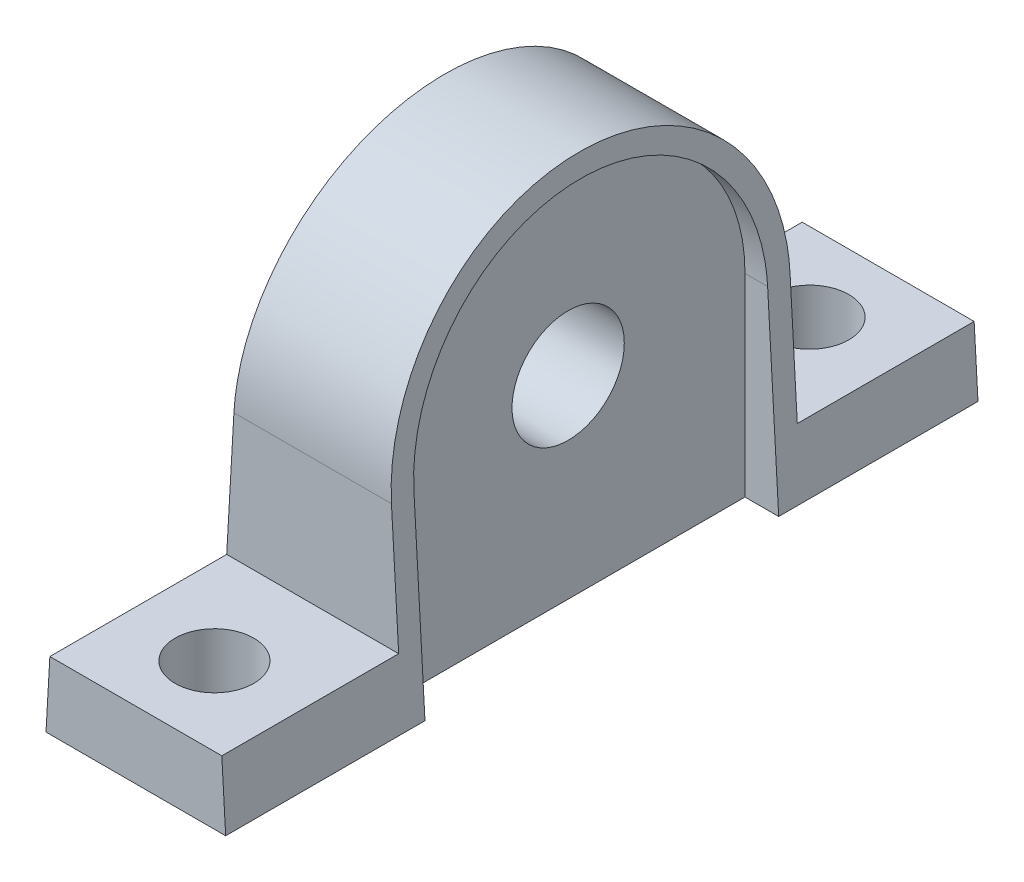
ISO-10303-21;
HEADER;
FILE_DESCRIPTION(('STEP AP214'),'2;1');
FILE_NAME('part.step','',(''),(''),'','','');
FILE_SCHEMA(('AUTOMOTIVE_DESIGN { 1 0 10303 214 1 1 1 1 }'));
ENDSEC;
DATA;
#1=APPLICATION_CONTEXT('core data for automotive mechanical design processes');
#2=APPLICATION_PROTOCOL_DEFINITION('international standard','automotive_design',2000,#1);
#3=PRODUCT_CONTEXT('',#1,'mechanical');
#4=PRODUCT('Part','Part','',(#3));
#5=PRODUCT_RELATED_PRODUCT_CATEGORY('part','',(#4));
#6=PRODUCT_DEFINITION_FORMATION('','',#4);
#7=PRODUCT_DEFINITION_CONTEXT('part definition',#1,'design');
#8=PRODUCT_DEFINITION('design','',#6,#7);
#9=PRODUCT_DEFINITION_SHAPE('','',#8);
#10=(LENGTH_UNIT() NAMED_UNIT(*) SI_UNIT(.MILLI.,.METRE.));
#11=(NAMED_UNIT(*) PLANE_ANGLE_UNIT() SI_UNIT($,.RADIAN.));
#12=(NAMED_UNIT(*) SI_UNIT($,.STERADIAN.) SOLID_ANGLE_UNIT());
#13=UNCERTAINTY_MEASURE_WITH_UNIT(LENGTH_MEASURE(1.E-05),#10,'distance_accuracy_value','');
#14=(GEOMETRIC_REPRESENTATION_CONTEXT(3) GLOBAL_UNCERTAINTY_ASSIGNED_CONTEXT((#13)) GLOBAL_UNIT_ASSIGNED_CONTEXT((#10,
#11,#12)) REPRESENTATION_CONTEXT('',''));
#15=CARTESIAN_POINT('',(0.,0.,0.));
#16=DIRECTION('',(0.,0.,1.));
#17=DIRECTION('',(1.,0.,0.));
#18=AXIS2_PLACEMENT_3D('',#15,#16,#17);
#19=CARTESIAN_POINT('',(-5.,0.,0.));
#20=DIRECTION('',(-1.,0.,0.));
#21=DIRECTION('',(0.,0.,-1.));
#22=AXIS2_PLACEMENT_3D('',#19,#20,#21);
#23=PLANE('',#22);
#24=DIRECTION('',(0.,-1.,0.));
#25=VECTOR('',#24,1.);
#26=CARTESIAN_POINT('',(-5.,0.,17.75));
#27=LINE('',#26,#25);
#28=CARTESIAN_POINT('',(-5.,17.25,17.75));
#29=VERTEX_POINT('',#28);
#30=CARTESIAN_POINT('',(-5.,0.,17.75));
#31=VERTEX_POINT('',#30);
#32=EDGE_CURVE('E193',#29,#31,#27,.T.);
#33=ORIENTED_EDGE('',*,*,#32,.T.);
#34=DIRECTION('',(0.,0.,-1.));
#35=VECTOR('',#34,1.);
#36=CARTESIAN_POINT('',(-5.,0.,0.));
#37=LINE('',#36,#35);
#38=CARTESIAN_POINT('',(-5.,0.,49.25));
#39=VERTEX_POINT('',#38);
#40=EDGE_CURVE('E204',#39,#31,#37,.T.);
#41=ORIENTED_EDGE('',*,*,#40,.F.);
#42=DIRECTION('',(0.,-1.,0.));
#43=VECTOR('',#42,1.);
#44=CARTESIAN_POINT('',(-5.,0.,49.25));
#45=LINE('',#44,#43);
#46=CARTESIAN_POINT('',(-5.,17.25,49.25));
#47=VERTEX_POINT('',#46);
#48=EDGE_CURVE('E209',#47,#39,#45,.T.);
#49=ORIENTED_EDGE('',*,*,#48,.F.);
#50=CARTESIAN_POINT('',(-5.,17.25,33.5));
#51=DIRECTION('',(1.,0.,0.));
#52=DIRECTION('',(0.,0.,-1.));
#53=AXIS2_PLACEMENT_3D('',#50,#51,#52);
#54=CIRCLE('',#53,15.75);
#55=EDGE_CURVE('E197',#29,#47,#54,.T.);
#56=ORIENTED_EDGE('',*,*,#55,.F.);
#57=EDGE_LOOP('',(#33,#41,#49,#56));
#58=FACE_BOUND('',#57,.T.);
#59=CARTESIAN_POINT('',(-5.,17.25,33.5));
#60=DIRECTION('',(-1.,0.,0.));
#61=DIRECTION('',(0.,0.,1.));
#62=AXIS2_PLACEMENT_3D('',#59,#60,#61);
#63=CIRCLE('',#62,7.);
#64=CARTESIAN_POINT('',(-5.,17.25,40.5));
#65=VERTEX_POINT('',#64);
#66=EDGE_CURVE('E325',#65,#65,#63,.T.);
#67=ORIENTED_EDGE('',*,*,#66,.F.);
#68=EDGE_LOOP('',(#67));
#69=FACE_BOUND('',#68,.T.);
#70=ADVANCED_FACE('F72',(#58,#69),#23,.T.);
#71=CARTESIAN_POINT('',(-15.,17.25,33.5));
#72=DIRECTION('',(1.,0.,0.));
#73=DIRECTION('',(0.,0.,-1.));
#74=AXIS2_PLACEMENT_3D('',#71,#72,#73);
#75=CYLINDRICAL_SURFACE('',#74,5.);
#76=CARTESIAN_POINT('',(5.,17.25,33.5));
#77=DIRECTION('',(1.,0.,0.));
#78=DIRECTION('',(0.,0.,-1.));
#79=AXIS2_PLACEMENT_3D('',#76,#77,#78);
#80=CIRCLE('',#79,5.);
#81=CARTESIAN_POINT('',(5.,17.25,28.5));
#82=VERTEX_POINT('',#81);
#83=EDGE_CURVE('E231',#82,#82,#80,.F.);
#84=ORIENTED_EDGE('',*,*,#83,.F.);
#85=EDGE_LOOP('',(#84));
#86=FACE_BOUND('',#85,.T.);
#87=CARTESIAN_POINT('',(-10.,17.25,33.5));
#88=DIRECTION('',(1.,0.,0.));
#89=DIRECTION('',(0.,0.,-1.));
#90=AXIS2_PLACEMENT_3D('',#87,#88,#89);
#91=CIRCLE('',#90,5.);
#92=CARTESIAN_POINT('',(-10.,17.25,28.5));
#93=VERTEX_POINT('',#92);
#94=EDGE_CURVE('E320',#93,#93,#91,.T.);
#95=ORIENTED_EDGE('',*,*,#94,.F.);
#96=EDGE_LOOP('',(#95));
#97=FACE_BOUND('',#96,.T.);
#98=ADVANCED_FACE('F342',(#86,#97),#75,.F.);
#99=CARTESIAN_POINT('',(8.,0.,67.));
#100=DIRECTION('',(-0.998371334423977,-0.0570497905385129,0.));
#101=DIRECTION('',(0.0570497905385129,-0.998371334423977,0.));
#102=AXIS2_PLACEMENT_3D('',#99,#100,#101);
#103=PLANE('',#102);
#104=DIRECTION('',(-0.0570497905385129,0.998371334423977,0.));
#105=VECTOR('',#104,1.);
#106=CARTESIAN_POINT('',(8.,0.,17.75));
#107=LINE('',#106,#105);
#108=CARTESIAN_POINT('',(8.,0.,17.75));
#109=VERTEX_POINT('',#108);
#110=CARTESIAN_POINT('',(7.01428571428572,17.25,17.75));
#111=VERTEX_POINT('',#110);
#112=EDGE_CURVE('E243',#109,#111,#107,.T.);
#113=ORIENTED_EDGE('',*,*,#112,.F.);
#114=DIRECTION('',(0.,0.,-1.));
#115=VECTOR('',#114,1.);
#116=CARTESIAN_POINT('',(8.,0.,67.));
#117=LINE('',#116,#115);
#118=CARTESIAN_POINT('',(8.,0.,0.));
#119=VERTEX_POINT('',#118);
#120=EDGE_CURVE('E283',#109,#119,#117,.T.);
#121=ORIENTED_EDGE('',*,*,#120,.T.);
#122=DIRECTION('',(-0.0570497905385129,0.998371334423977,0.));
#123=VECTOR('',#122,1.);
#124=CARTESIAN_POINT('',(8.,0.,0.));
#125=LINE('',#124,#123);
#126=CARTESIAN_POINT('',(7.65714285714286,6.,0.));
#127=VERTEX_POINT('',#126);
#128=EDGE_CURVE('E274',#119,#127,#125,.T.);
#129=ORIENTED_EDGE('',*,*,#128,.T.);
#130=DIRECTION('',(0.,0.,-1.));
#131=VECTOR('',#130,1.);
#132=CARTESIAN_POINT('',(7.65714285714286,6.,67.));
#133=LINE('',#132,#131);
#134=CARTESIAN_POINT('',(7.65714285714286,6.,15.75));
#135=VERTEX_POINT('',#134);
#136=EDGE_CURVE('E268',#135,#127,#133,.T.);
#137=ORIENTED_EDGE('',*,*,#136,.F.);
#138=DIRECTION('',(0.0570497905385129,-0.998371334423977,0.));
#139=VECTOR('',#138,1.);
#140=CARTESIAN_POINT('',(8.,0.,15.75));
#141=LINE('',#140,#139);
#142=CARTESIAN_POINT('',(7.01428571428572,17.25,15.75));
#143=VERTEX_POINT('',#142);
#144=EDGE_CURVE('E272',#143,#135,#141,.T.);
#145=ORIENTED_EDGE('',*,*,#144,.F.);
#146=CARTESIAN_POINT('',(7.01428571428572,17.25,33.5));
#147=DIRECTION('',(-0.998371334423977,-0.0570497905385129,0.));
#148=DIRECTION('',(0.057049790538513,-0.998371334423977,0.));
#149=AXIS2_PLACEMENT_3D('',#146,#147,#148);
#150=ELLIPSE('',#149,17.7789559735718,17.75);
#151=CARTESIAN_POINT('',(7.01428571428572,17.25,51.25));
#152=VERTEX_POINT('',#151);
#153=EDGE_CURVE('E270',#143,#152,#150,.F.);
#154=ORIENTED_EDGE('',*,*,#153,.T.);
#155=DIRECTION('',(0.0570497905385129,-0.998371334423977,0.));
#156=VECTOR('',#155,1.);
#157=CARTESIAN_POINT('',(8.,0.,51.25));
#158=LINE('',#157,#156);
#159=CARTESIAN_POINT('',(7.65714285714286,6.,51.25));
#160=VERTEX_POINT('',#159);
#161=EDGE_CURVE('E257',#152,#160,#158,.T.);
#162=ORIENTED_EDGE('',*,*,#161,.T.);
#163=DIRECTION('',(0.,0.,1.));
#164=VECTOR('',#163,1.);
#165=CARTESIAN_POINT('',(7.65714285714286,6.,67.));
#166=LINE('',#165,#164);
#167=CARTESIAN_POINT('',(7.65714285714286,6.,67.));
#168=VERTEX_POINT('',#167);
#169=EDGE_CURVE('E254',#160,#168,#166,.T.);
#170=ORIENTED_EDGE('',*,*,#169,.T.);
#171=DIRECTION('',(-0.0570497905385129,0.998371334423977,0.));
#172=VECTOR('',#171,1.);
#173=CARTESIAN_POINT('',(8.,0.,67.));
#174=LINE('',#173,#172);
#175=CARTESIAN_POINT('',(8.,0.,67.));
#176=VERTEX_POINT('',#175);
#177=EDGE_CURVE('E275',#176,#168,#174,.T.);
#178=ORIENTED_EDGE('',*,*,#177,.F.);
#179=CARTESIAN_POINT('',(8.,0.,49.25));
#180=VERTEX_POINT('',#179);
#181=EDGE_CURVE('E291',#176,#180,#117,.T.);
#182=ORIENTED_EDGE('',*,*,#181,.T.);
#183=DIRECTION('',(-0.0570497905385129,0.998371334423977,0.));
#184=VECTOR('',#183,1.);
#185=CARTESIAN_POINT('',(8.,0.,49.25));
#186=LINE('',#185,#184);
#187=CARTESIAN_POINT('',(7.01428571428572,17.25,49.25));
#188=VERTEX_POINT('',#187);
#189=EDGE_CURVE('E240',#180,#188,#186,.T.);
#190=ORIENTED_EDGE('',*,*,#189,.T.);
#191=CARTESIAN_POINT('',(7.01428571428572,17.25,33.5));
#192=DIRECTION('',(-0.998371334423977,-0.0570497905385129,0.));
#193=DIRECTION('',(0.057049790538513,-0.998371334423977,0.));
#194=AXIS2_PLACEMENT_3D('',#191,#192,#193);
#195=ELLIPSE('',#194,15.7756933286623,15.75);
#196=EDGE_CURVE('E311',#188,#111,#195,.T.);
#197=ORIENTED_EDGE('',*,*,#196,.T.);
#198=EDGE_LOOP('',(#113,#121,#129,#137,#145,#154,#162,#170,#178,#182,#190,#197));
#199=FACE_BOUND('',#198,.T.);
#200=ADVANCED_FACE('F74',(#199),#103,.F.);
#201=CARTESIAN_POINT('',(8.,0.,67.));
#202=DIRECTION('',(0.,1.,0.));
#203=DIRECTION('',(0.,0.,1.));
#204=AXIS2_PLACEMENT_3D('',#201,#202,#203);
#205=PLANE('',#204);
#206=CARTESIAN_POINT('',(0.,0.,7.00000000000001));
#207=DIRECTION('',(0.,-1.,0.));
#208=DIRECTION('',(0.,0.,1.));
#209=AXIS2_PLACEMENT_3D('',#206,#207,#208);
#210=CIRCLE('',#209,3.5);
#211=CARTESIAN_POINT('',(0.,0.,10.5));
#212=VERTEX_POINT('',#211);
#213=EDGE_CURVE('E332',#212,#212,#210,.T.);
#214=ORIENTED_EDGE('',*,*,#213,.F.);
#215=EDGE_LOOP('',(#214));
#216=FACE_BOUND('',#215,.T.);
#217=CARTESIAN_POINT('',(0.,0.,60.));
#218=DIRECTION('',(0.,-1.,0.));
#219=DIRECTION('',(0.,0.,-1.));
#220=AXIS2_PLACEMENT_3D('',#217,#218,#219);
#221=CIRCLE('',#220,3.5);
#222=CARTESIAN_POINT('',(0.,0.,56.5));
#223=VERTEX_POINT('',#222);
#224=EDGE_CURVE('E321',#223,#223,#221,.T.);
#225=ORIENTED_EDGE('',*,*,#224,.F.);
#226=EDGE_LOOP('',(#225));
#227=FACE_BOUND('',#226,.T.);
#228=ORIENTED_EDGE('',*,*,#40,.T.);
#229=DIRECTION('',(-1.,0.,0.));
#230=VECTOR('',#229,1.);
#231=CARTESIAN_POINT('',(-5.,0.,17.75));
#232=LINE('',#231,#230);
#233=CARTESIAN_POINT('',(-8.,0.,17.75));
#234=VERTEX_POINT('',#233);
#235=EDGE_CURVE('E189',#31,#234,#232,.T.);
#236=ORIENTED_EDGE('',*,*,#235,.T.);
#237=DIRECTION('',(0.,0.,-1.));
#238=VECTOR('',#237,1.);
#239=CARTESIAN_POINT('',(-8.,0.,67.));
#240=LINE('',#239,#238);
#241=CARTESIAN_POINT('',(-8.,0.,0.));
#242=VERTEX_POINT('',#241);
#243=EDGE_CURVE('E294',#234,#242,#240,.T.);
#244=ORIENTED_EDGE('',*,*,#243,.T.);
#245=DIRECTION('',(1.,0.,0.));
#246=VECTOR('',#245,1.);
#247=CARTESIAN_POINT('',(8.,0.,0.));
#248=LINE('',#247,#246);
#249=EDGE_CURVE('E279',#242,#119,#248,.T.);
#250=ORIENTED_EDGE('',*,*,#249,.T.);
#251=ORIENTED_EDGE('',*,*,#120,.F.);
#252=DIRECTION('',(1.,0.,0.));
#253=VECTOR('',#252,1.);
#254=CARTESIAN_POINT('',(5.,0.,17.75));
#255=LINE('',#254,#253);
#256=CARTESIAN_POINT('',(5.,0.,17.75));
#257=VERTEX_POINT('',#256);
#258=EDGE_CURVE('E229',#257,#109,#255,.T.);
#259=ORIENTED_EDGE('',*,*,#258,.F.);
#260=DIRECTION('',(0.,0.,-1.));
#261=VECTOR('',#260,1.);
#262=CARTESIAN_POINT('',(5.,0.,0.));
#263=LINE('',#262,#261);
#264=CARTESIAN_POINT('',(5.,0.,49.25));
#265=VERTEX_POINT('',#264);
#266=EDGE_CURVE('E226',#265,#257,#263,.T.);
#267=ORIENTED_EDGE('',*,*,#266,.F.);
#268=DIRECTION('',(1.,0.,0.));
#269=VECTOR('',#268,1.);
#270=CARTESIAN_POINT('',(5.,0.,49.25));
#271=LINE('',#270,#269);
#272=EDGE_CURVE('E232',#265,#180,#271,.T.);
#273=ORIENTED_EDGE('',*,*,#272,.T.);
#274=ORIENTED_EDGE('',*,*,#181,.F.);
#275=DIRECTION('',(1.,0.,0.));
#276=VECTOR('',#275,1.);
#277=CARTESIAN_POINT('',(8.,0.,67.));
#278=LINE('',#277,#276);
#279=CARTESIAN_POINT('',(-8.,0.,67.));
#280=VERTEX_POINT('',#279);
#281=EDGE_CURVE('E281',#280,#176,#278,.T.);
#282=ORIENTED_EDGE('',*,*,#281,.F.);
#283=CARTESIAN_POINT('',(-8.,0.,49.25));
#284=VERTEX_POINT('',#283);
#285=EDGE_CURVE('E295',#280,#284,#240,.T.);
#286=ORIENTED_EDGE('',*,*,#285,.T.);
#287=DIRECTION('',(-1.,0.,0.));
#288=VECTOR('',#287,1.);
#289=CARTESIAN_POINT('',(-5.,0.,49.25));
#290=LINE('',#289,#288);
#291=EDGE_CURVE('E89',#39,#284,#290,.T.);
#292=ORIENTED_EDGE('',*,*,#291,.F.);
#293=EDGE_LOOP('',(#228,#236,#244,#250,#251,#259,#267,#273,#274,#282,#286,#292));
#294=FACE_BOUND('',#293,.T.);
#295=ADVANCED_FACE('F207',(#216,#227,#294),#205,.F.);
#296=CARTESIAN_POINT('',(-8.,0.,67.));
#297=DIRECTION('',(0.998371334423977,-0.0570497905385129,0.));
#298=DIRECTION('',(0.0570497905385129,0.998371334423977,0.));
#299=AXIS2_PLACEMENT_3D('',#296,#297,#298);
#300=PLANE('',#299);
#301=ORIENTED_EDGE('',*,*,#243,.F.);
#302=DIRECTION('',(0.0570497905385129,0.998371334423977,0.));
#303=VECTOR('',#302,1.);
#304=CARTESIAN_POINT('',(-8.,0.,17.75));
#305=LINE('',#304,#303);
#306=CARTESIAN_POINT('',(-7.01428571428572,17.25,17.75));
#307=VERTEX_POINT('',#306);
#308=EDGE_CURVE('E12',#234,#307,#305,.T.);
#309=ORIENTED_EDGE('',*,*,#308,.T.);
#310=CARTESIAN_POINT('',(-7.01428571428572,17.25,33.5));
#311=DIRECTION('',(0.998371334423977,-0.0570497905385129,0.));
#312=DIRECTION('',(-0.057049790538513,-0.998371334423977,0.));
#313=AXIS2_PLACEMENT_3D('',#310,#311,#312);
#314=ELLIPSE('',#313,15.7756933286623,15.75);
#315=CARTESIAN_POINT('',(-7.01428571428571,17.25,49.25));
#316=VERTEX_POINT('',#315);
#317=EDGE_CURVE('E81',#316,#307,#314,.F.);
#318=ORIENTED_EDGE('',*,*,#317,.F.);
#319=DIRECTION('',(0.0570497905385129,0.998371334423977,0.));
#320=VECTOR('',#319,1.);
#321=CARTESIAN_POINT('',(-8.,0.,49.25));
#322=LINE('',#321,#320);
#323=EDGE_CURVE('E316',#284,#316,#322,.T.);
#324=ORIENTED_EDGE('',*,*,#323,.F.);
#325=ORIENTED_EDGE('',*,*,#285,.F.);
#326=DIRECTION('',(-0.0570497905385129,-0.998371334423977,0.));
#327=VECTOR('',#326,1.);
#328=CARTESIAN_POINT('',(-8.,0.,67.));
#329=LINE('',#328,#327);
#330=CARTESIAN_POINT('',(-7.65714285714286,6.,67.));
#331=VERTEX_POINT('',#330);
#332=EDGE_CURVE('E278',#331,#280,#329,.T.);
#333=ORIENTED_EDGE('',*,*,#332,.F.);
#334=DIRECTION('',(0.,0.,-1.));
#335=VECTOR('',#334,1.);
#336=CARTESIAN_POINT('',(-7.65714285714286,6.,67.));
#337=LINE('',#336,#335);
#338=CARTESIAN_POINT('',(-7.65714285714286,6.,51.25));
#339=VERTEX_POINT('',#338);
#340=EDGE_CURVE('E249',#331,#339,#337,.T.);
#341=ORIENTED_EDGE('',*,*,#340,.T.);
#342=DIRECTION('',(0.0570497905385129,0.998371334423977,0.));
#343=VECTOR('',#342,1.);
#344=CARTESIAN_POINT('',(-8.,0.,51.25));
#345=LINE('',#344,#343);
#346=CARTESIAN_POINT('',(-7.01428571428572,17.25,51.25));
#347=VERTEX_POINT('',#346);
#348=EDGE_CURVE('E308',#339,#347,#345,.T.);
#349=ORIENTED_EDGE('',*,*,#348,.T.);
#350=CARTESIAN_POINT('',(-7.01428571428572,17.25,33.5));
#351=DIRECTION('',(0.998371334423977,-0.0570497905385129,0.));
#352=DIRECTION('',(0.057049790538513,0.998371334423977,0.));
#353=AXIS2_PLACEMENT_3D('',#350,#351,#352);
#354=ELLIPSE('',#353,17.7789559735718,17.75);
#355=CARTESIAN_POINT('',(-7.01428571428572,17.25,15.75));
#356=VERTEX_POINT('',#355);
#357=EDGE_CURVE('E300',#347,#356,#354,.F.);
#358=ORIENTED_EDGE('',*,*,#357,.T.);
#359=DIRECTION('',(0.0570497905385129,0.998371334423977,0.));
#360=VECTOR('',#359,1.);
#361=CARTESIAN_POINT('',(-8.,0.,15.75));
#362=LINE('',#361,#360);
#363=CARTESIAN_POINT('',(-7.65714285714286,6.,15.75));
#364=VERTEX_POINT('',#363);
#365=EDGE_CURVE('E303',#364,#356,#362,.T.);
#366=ORIENTED_EDGE('',*,*,#365,.F.);
#367=DIRECTION('',(0.,0.,1.));
#368=VECTOR('',#367,1.);
#369=CARTESIAN_POINT('',(-7.65714285714286,6.,67.));
#370=LINE('',#369,#368);
#371=CARTESIAN_POINT('',(-7.65714285714286,6.,0.));
#372=VERTEX_POINT('',#371);
#373=EDGE_CURVE('E264',#372,#364,#370,.T.);
#374=ORIENTED_EDGE('',*,*,#373,.F.);
#375=DIRECTION('',(-0.0570497905385129,-0.998371334423977,0.));
#376=VECTOR('',#375,1.);
#377=CARTESIAN_POINT('',(-8.,0.,0.));
#378=LINE('',#377,#376);
#379=EDGE_CURVE('E286',#372,#242,#378,.T.);
#380=ORIENTED_EDGE('',*,*,#379,.T.);
#381=EDGE_LOOP('',(#301,#309,#318,#324,#325,#333,#341,#349,#358,#366,#374,#380));
#382=FACE_BOUND('',#381,.T.);
#383=ADVANCED_FACE('F403',(#382),#300,.F.);
#384=CARTESIAN_POINT('',(0.,0.,0.));
#385=DIRECTION('',(0.,0.,-1.));
#386=DIRECTION('',(-1.,0.,0.));
#387=AXIS2_PLACEMENT_3D('',#384,#385,#386);
#388=PLANE('',#387);
#389=ORIENTED_EDGE('',*,*,#379,.F.);
#390=DIRECTION('',(1.,0.,0.));
#391=VECTOR('',#390,1.);
#392=CARTESIAN_POINT('',(0.,6.,0.));
#393=LINE('',#392,#391);
#394=EDGE_CURVE('E297',#372,#127,#393,.T.);
#395=ORIENTED_EDGE('',*,*,#394,.T.);
#396=ORIENTED_EDGE('',*,*,#128,.F.);
#397=ORIENTED_EDGE('',*,*,#249,.F.);
#398=EDGE_LOOP('',(#389,#395,#396,#397));
#399=FACE_BOUND('',#398,.T.);
#400=ADVANCED_FACE('F399',(#399),#388,.T.);
#401=CARTESIAN_POINT('',(0.,0.,67.));
#402=DIRECTION('',(0.,0.,-1.));
#403=DIRECTION('',(-1.,0.,0.));
#404=AXIS2_PLACEMENT_3D('',#401,#402,#403);
#405=PLANE('',#404);
#406=ORIENTED_EDGE('',*,*,#177,.T.);
#407=DIRECTION('',(-1.,0.,0.));
#408=VECTOR('',#407,1.);
#409=CARTESIAN_POINT('',(0.,6.,67.));
#410=LINE('',#409,#408);
#411=EDGE_CURVE('E305',#168,#331,#410,.T.);
#412=ORIENTED_EDGE('',*,*,#411,.T.);
#413=ORIENTED_EDGE('',*,*,#332,.T.);
#414=ORIENTED_EDGE('',*,*,#281,.T.);
#415=EDGE_LOOP('',(#406,#412,#413,#414));
#416=FACE_BOUND('',#415,.T.);
#417=ADVANCED_FACE('F392',(#416),#405,.F.);
#418=CARTESIAN_POINT('',(-15.,0.,15.75));
#419=DIRECTION('',(0.,0.,-1.));
#420=DIRECTION('',(-1.,0.,0.));
#421=AXIS2_PLACEMENT_3D('',#418,#419,#420);
#422=PLANE('',#421);
#423=ORIENTED_EDGE('',*,*,#144,.T.);
#424=DIRECTION('',(1.,0.,0.));
#425=VECTOR('',#424,1.);
#426=CARTESIAN_POINT('',(-15.,6.,15.75));
#427=LINE('',#426,#425);
#428=EDGE_CURVE('E261',#364,#135,#427,.T.);
#429=ORIENTED_EDGE('',*,*,#428,.F.);
#430=ORIENTED_EDGE('',*,*,#365,.T.);
#431=DIRECTION('',(1.,0.,0.));
#432=VECTOR('',#431,1.);
#433=CARTESIAN_POINT('',(-15.,17.25,15.75));
#434=LINE('',#433,#432);
#435=EDGE_CURVE('E260',#356,#143,#434,.T.);
#436=ORIENTED_EDGE('',*,*,#435,.T.);
#437=EDGE_LOOP('',(#423,#429,#430,#436));
#438=FACE_BOUND('',#437,.T.);
#439=ADVANCED_FACE('F389',(#438),#422,.T.);
#440=CARTESIAN_POINT('',(-15.,17.25,33.5));
#441=DIRECTION('',(1.,0.,0.));
#442=DIRECTION('',(0.,0.,-1.));
#443=AXIS2_PLACEMENT_3D('',#440,#441,#442);
#444=CYLINDRICAL_SURFACE('',#443,17.75);
#445=ORIENTED_EDGE('',*,*,#435,.F.);
#446=ORIENTED_EDGE('',*,*,#357,.F.);
#447=DIRECTION('',(1.,0.,0.));
#448=VECTOR('',#447,1.);
#449=CARTESIAN_POINT('',(-15.,17.25,51.25));
#450=LINE('',#449,#448);
#451=EDGE_CURVE('E245',#347,#152,#450,.T.);
#452=ORIENTED_EDGE('',*,*,#451,.T.);
#453=ORIENTED_EDGE('',*,*,#153,.F.);
#454=EDGE_LOOP('',(#445,#446,#452,#453));
#455=FACE_BOUND('',#454,.T.);
#456=ADVANCED_FACE('F387',(#455),#444,.T.);
#457=CARTESIAN_POINT('',(-15.,6.,0.));
#458=DIRECTION('',(0.,1.,0.));
#459=DIRECTION('',(0.,0.,1.));
#460=AXIS2_PLACEMENT_3D('',#457,#458,#459);
#461=PLANE('',#460);
#462=CARTESIAN_POINT('',(0.,6.,7.00000000000001));
#463=DIRECTION('',(0.,1.,0.));
#464=DIRECTION('',(0.,0.,1.));
#465=AXIS2_PLACEMENT_3D('',#462,#463,#464);
#466=CIRCLE('',#465,3.5);
#467=CARTESIAN_POINT('',(0.,6.,10.5));
#468=VERTEX_POINT('',#467);
#469=EDGE_CURVE('E76',#468,#468,#466,.T.);
#470=ORIENTED_EDGE('',*,*,#469,.F.);
#471=EDGE_LOOP('',(#470));
#472=FACE_BOUND('',#471,.T.);
#473=ORIENTED_EDGE('',*,*,#136,.T.);
#474=ORIENTED_EDGE('',*,*,#394,.F.);
#475=ORIENTED_EDGE('',*,*,#373,.T.);
#476=ORIENTED_EDGE('',*,*,#428,.T.);
#477=EDGE_LOOP('',(#473,#474,#475,#476));
#478=FACE_BOUND('',#477,.T.);
#479=ADVANCED_FACE('F383',(#472,#478),#461,.T.);
#480=CARTESIAN_POINT('',(-15.,0.,51.25));
#481=DIRECTION('',(0.,0.,-1.));
#482=DIRECTION('',(-1.,0.,0.));
#483=AXIS2_PLACEMENT_3D('',#480,#481,#482);
#484=PLANE('',#483);
#485=ORIENTED_EDGE('',*,*,#451,.F.);
#486=ORIENTED_EDGE('',*,*,#348,.F.);
#487=DIRECTION('',(1.,0.,0.));
#488=VECTOR('',#487,1.);
#489=CARTESIAN_POINT('',(-15.,6.,51.25));
#490=LINE('',#489,#488);
#491=EDGE_CURVE('E246',#339,#160,#490,.T.);
#492=ORIENTED_EDGE('',*,*,#491,.T.);
#493=ORIENTED_EDGE('',*,*,#161,.F.);
#494=EDGE_LOOP('',(#485,#486,#492,#493));
#495=FACE_BOUND('',#494,.T.);
#496=ADVANCED_FACE('F380',(#495),#484,.F.);
#497=CARTESIAN_POINT('',(-15.,6.,0.));
#498=DIRECTION('',(0.,-1.,0.));
#499=DIRECTION('',(0.,0.,-1.));
#500=AXIS2_PLACEMENT_3D('',#497,#498,#499);
#501=PLANE('',#500);
#502=CARTESIAN_POINT('',(0.,6.,60.));
#503=DIRECTION('',(0.,-1.,0.));
#504=DIRECTION('',(0.,0.,-1.));
#505=AXIS2_PLACEMENT_3D('',#502,#503,#504);
#506=CIRCLE('',#505,3.5);
#507=CARTESIAN_POINT('',(0.,6.,56.5));
#508=VERTEX_POINT('',#507);
#509=EDGE_CURVE('E318',#508,#508,#506,.T.);
#510=ORIENTED_EDGE('',*,*,#509,.T.);
#511=EDGE_LOOP('',(#510));
#512=FACE_BOUND('',#511,.T.);
#513=ORIENTED_EDGE('',*,*,#491,.F.);
#514=ORIENTED_EDGE('',*,*,#340,.F.);
#515=ORIENTED_EDGE('',*,*,#411,.F.);
#516=ORIENTED_EDGE('',*,*,#169,.F.);
#517=EDGE_LOOP('',(#513,#514,#515,#516));
#518=FACE_BOUND('',#517,.T.);
#519=ADVANCED_FACE('F373',(#512,#518),#501,.F.);
#520=CARTESIAN_POINT('',(5.,17.25,33.5));
#521=DIRECTION('',(1.,0.,0.));
#522=DIRECTION('',(0.,0.,-1.));
#523=AXIS2_PLACEMENT_3D('',#520,#521,#522);
#524=CYLINDRICAL_SURFACE('',#523,15.75);
#525=DIRECTION('',(1.,0.,0.));
#526=VECTOR('',#525,1.);
#527=CARTESIAN_POINT('',(5.,17.25,49.25));
#528=LINE('',#527,#526);
#529=CARTESIAN_POINT('',(5.,17.25,49.25));
#530=VERTEX_POINT('',#529);
#531=EDGE_CURVE('E235',#530,#188,#528,.T.);
#532=ORIENTED_EDGE('',*,*,#531,.F.);
#533=CARTESIAN_POINT('',(5.,17.25,33.5));
#534=DIRECTION('',(1.,0.,0.));
#535=DIRECTION('',(0.,0.,-1.));
#536=AXIS2_PLACEMENT_3D('',#533,#534,#535);
#537=CIRCLE('',#536,15.75);
#538=CARTESIAN_POINT('',(5.,17.25,17.75));
#539=VERTEX_POINT('',#538);
#540=EDGE_CURVE('E223',#539,#530,#537,.T.);
#541=ORIENTED_EDGE('',*,*,#540,.F.);
#542=DIRECTION('',(1.,0.,0.));
#543=VECTOR('',#542,1.);
#544=CARTESIAN_POINT('',(5.,17.25,17.75));
#545=LINE('',#544,#543);
#546=EDGE_CURVE('E228',#539,#111,#545,.T.);
#547=ORIENTED_EDGE('',*,*,#546,.T.);
#548=ORIENTED_EDGE('',*,*,#196,.F.);
#549=EDGE_LOOP('',(#532,#541,#547,#548));
#550=FACE_BOUND('',#549,.T.);
#551=ADVANCED_FACE('F370',(#550),#524,.F.);
#552=CARTESIAN_POINT('',(5.,0.,17.75));
#553=DIRECTION('',(0.,0.,1.));
#554=DIRECTION('',(1.,0.,0.));
#555=AXIS2_PLACEMENT_3D('',#552,#553,#554);
#556=PLANE('',#555);
#557=ORIENTED_EDGE('',*,*,#112,.T.);
#558=ORIENTED_EDGE('',*,*,#546,.F.);
#559=DIRECTION('',(0.,-1.,0.));
#560=VECTOR('',#559,1.);
#561=CARTESIAN_POINT('',(5.,0.,17.75));
#562=LINE('',#561,#560);
#563=EDGE_CURVE('E217',#539,#257,#562,.T.);
#564=ORIENTED_EDGE('',*,*,#563,.T.);
#565=ORIENTED_EDGE('',*,*,#258,.T.);
#566=EDGE_LOOP('',(#557,#558,#564,#565));
#567=FACE_BOUND('',#566,.T.);
#568=ADVANCED_FACE('F368',(#567),#556,.T.);
#569=CARTESIAN_POINT('',(5.,0.,49.25));
#570=DIRECTION('',(0.,0.,1.));
#571=DIRECTION('',(1.,0.,0.));
#572=AXIS2_PLACEMENT_3D('',#569,#570,#571);
#573=PLANE('',#572);
#574=ORIENTED_EDGE('',*,*,#272,.F.);
#575=DIRECTION('',(0.,-1.,0.));
#576=VECTOR('',#575,1.);
#577=CARTESIAN_POINT('',(5.,0.,49.25));
#578=LINE('',#577,#576);
#579=EDGE_CURVE('E97',#530,#265,#578,.T.);
#580=ORIENTED_EDGE('',*,*,#579,.F.);
#581=ORIENTED_EDGE('',*,*,#531,.T.);
#582=ORIENTED_EDGE('',*,*,#189,.F.);
#583=EDGE_LOOP('',(#574,#580,#581,#582));
#584=FACE_BOUND('',#583,.T.);
#585=ADVANCED_FACE('F365',(#584),#573,.F.);
#586=CARTESIAN_POINT('',(5.,0.,0.));
#587=DIRECTION('',(1.,0.,0.));
#588=DIRECTION('',(0.,0.,-1.));
#589=AXIS2_PLACEMENT_3D('',#586,#587,#588);
#590=PLANE('',#589);
#591=ORIENTED_EDGE('',*,*,#563,.F.);
#592=ORIENTED_EDGE('',*,*,#540,.T.);
#593=ORIENTED_EDGE('',*,*,#579,.T.);
#594=ORIENTED_EDGE('',*,*,#266,.T.);
#595=EDGE_LOOP('',(#591,#592,#593,#594));
#596=FACE_BOUND('',#595,.T.);
#597=ORIENTED_EDGE('',*,*,#83,.T.);
#598=EDGE_LOOP('',(#597));
#599=FACE_BOUND('',#598,.T.);
#600=ADVANCED_FACE('F362',(#596,#599),#590,.T.);
#601=CARTESIAN_POINT('',(-5.,0.,17.75));
#602=DIRECTION('',(0.,0.,-1.));
#603=DIRECTION('',(-1.,0.,0.));
#604=AXIS2_PLACEMENT_3D('',#601,#602,#603);
#605=PLANE('',#604);
#606=ORIENTED_EDGE('',*,*,#235,.F.);
#607=ORIENTED_EDGE('',*,*,#32,.F.);
#608=DIRECTION('',(-1.,0.,0.));
#609=VECTOR('',#608,1.);
#610=CARTESIAN_POINT('',(-5.,17.25,17.75));
#611=LINE('',#610,#609);
#612=EDGE_CURVE('E215',#29,#307,#611,.T.);
#613=ORIENTED_EDGE('',*,*,#612,.T.);
#614=ORIENTED_EDGE('',*,*,#308,.F.);
#615=EDGE_LOOP('',(#606,#607,#613,#614));
#616=FACE_BOUND('',#615,.T.);
#617=ADVANCED_FACE('F191',(#616),#605,.F.);
#618=CARTESIAN_POINT('',(-5.,17.25,33.5));
#619=DIRECTION('',(-1.,0.,0.));
#620=DIRECTION('',(0.,0.,1.));
#621=AXIS2_PLACEMENT_3D('',#618,#619,#620);
#622=CYLINDRICAL_SURFACE('',#621,15.75);
#623=ORIENTED_EDGE('',*,*,#317,.T.);
#624=ORIENTED_EDGE('',*,*,#612,.F.);
#625=ORIENTED_EDGE('',*,*,#55,.T.);
#626=DIRECTION('',(-1.,0.,0.));
#627=VECTOR('',#626,1.);
#628=CARTESIAN_POINT('',(-5.,17.25,49.25));
#629=LINE('',#628,#627);
#630=EDGE_CURVE('E218',#47,#316,#629,.T.);
#631=ORIENTED_EDGE('',*,*,#630,.T.);
#632=EDGE_LOOP('',(#623,#624,#625,#631));
#633=FACE_BOUND('',#632,.T.);
#634=ADVANCED_FACE('F352',(#633),#622,.F.);
#635=CARTESIAN_POINT('',(-5.,0.,49.25));
#636=DIRECTION('',(0.,0.,-1.));
#637=DIRECTION('',(-1.,0.,0.));
#638=AXIS2_PLACEMENT_3D('',#635,#636,#637);
#639=PLANE('',#638);
#640=ORIENTED_EDGE('',*,*,#323,.T.);
#641=ORIENTED_EDGE('',*,*,#630,.F.);
#642=ORIENTED_EDGE('',*,*,#48,.T.);
#643=ORIENTED_EDGE('',*,*,#291,.T.);
#644=EDGE_LOOP('',(#640,#641,#642,#643));
#645=FACE_BOUND('',#644,.T.);
#646=ADVANCED_FACE('F355',(#645),#639,.T.);
#647=CARTESIAN_POINT('',(-10.,17.25,33.5));
#648=DIRECTION('',(1.,0.,0.));
#649=DIRECTION('',(0.,0.,-1.));
#650=AXIS2_PLACEMENT_3D('',#647,#648,#649);
#651=PLANE('',#650);
#652=CARTESIAN_POINT('',(-10.,17.25,33.5));
#653=DIRECTION('',(1.,0.,0.));
#654=DIRECTION('',(0.,0.,-1.));
#655=AXIS2_PLACEMENT_3D('',#652,#653,#654);
#656=CIRCLE('',#655,7.);
#657=CARTESIAN_POINT('',(-10.,17.25,26.5));
#658=VERTEX_POINT('',#657);
#659=EDGE_CURVE('E205',#658,#658,#656,.T.);
#660=ORIENTED_EDGE('',*,*,#659,.F.);
#661=EDGE_LOOP('',(#660));
#662=FACE_BOUND('',#661,.T.);
#663=ORIENTED_EDGE('',*,*,#94,.T.);
#664=EDGE_LOOP('',(#663));
#665=FACE_BOUND('',#664,.T.);
#666=ADVANCED_FACE('F359',(#662,#665),#651,.F.);
#667=CARTESIAN_POINT('',(14.7989898732233,17.25,33.5));
#668=DIRECTION('',(-1.,0.,0.));
#669=DIRECTION('',(0.,0.,1.));
#670=AXIS2_PLACEMENT_3D('',#667,#668,#669);
#671=CYLINDRICAL_SURFACE('',#670,7.);
#672=ORIENTED_EDGE('',*,*,#66,.T.);
#673=EDGE_LOOP('',(#672));
#674=FACE_BOUND('',#673,.T.);
#675=ORIENTED_EDGE('',*,*,#659,.T.);
#676=EDGE_LOOP('',(#675));
#677=FACE_BOUND('',#676,.T.);
#678=ADVANCED_FACE('F339',(#674,#677),#671,.T.);
#679=CARTESIAN_POINT('',(0.,10.,60.));
#680=DIRECTION('',(0.,-1.,0.));
#681=DIRECTION('',(0.,0.,-1.));
#682=AXIS2_PLACEMENT_3D('',#679,#680,#681);
#683=CYLINDRICAL_SURFACE('',#682,3.5);
#684=ORIENTED_EDGE('',*,*,#224,.T.);
#685=EDGE_LOOP('',(#684));
#686=FACE_BOUND('',#685,.T.);
#687=ORIENTED_EDGE('',*,*,#509,.F.);
#688=EDGE_LOOP('',(#687));
#689=FACE_BOUND('',#688,.T.);
#690=ADVANCED_FACE('F449',(#686,#689),#683,.F.);
#691=CARTESIAN_POINT('',(0.,10.,7.00000000000001));
#692=DIRECTION('',(0.,-1.,0.));
#693=DIRECTION('',(0.,0.,-1.));
#694=AXIS2_PLACEMENT_3D('',#691,#692,#693);
#695=CYLINDRICAL_SURFACE('',#694,3.5);
#696=ORIENTED_EDGE('',*,*,#469,.T.);
#697=EDGE_LOOP('',(#696));
#698=FACE_BOUND('',#697,.T.);
#699=ORIENTED_EDGE('',*,*,#213,.T.);
#700=EDGE_LOOP('',(#699));
#701=FACE_BOUND('',#700,.T.);
#702=ADVANCED_FACE('F454',(#698,#701),#695,.F.);
#703=CLOSED_SHELL('',(#70,#98,#200,#295,#383,#400,#417,#439,#456,#479,#496,#519,#551,#568,#585,
#600,#617,#634,#646,#666,#678,#690,#702));
#704=MANIFOLD_SOLID_BREP('B2',#703);
#705=ADVANCED_BREP_SHAPE_REPRESENTATION('',(#18,#704),#14);
#706=SHAPE_DEFINITION_REPRESENTATION(#9,#705);
ENDSEC;
END-ISO-10303-21;
